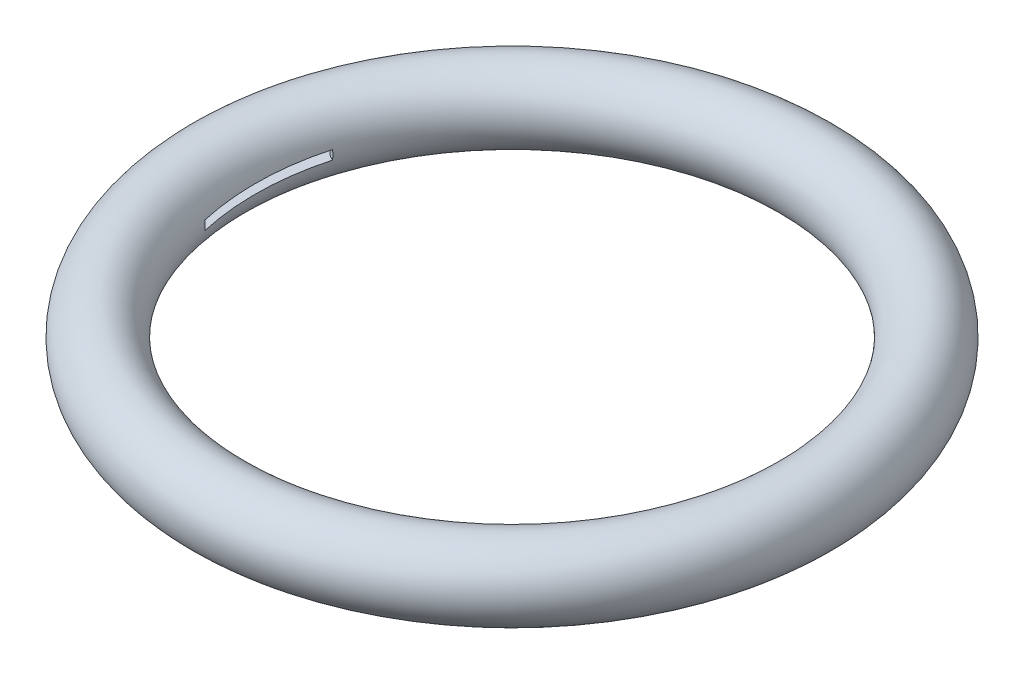
ISO-10303-21;
HEADER;
FILE_DESCRIPTION(('STEP AP214'),'2;1');
FILE_NAME('part.step','',(''),(''),'','','');
FILE_SCHEMA(('AUTOMOTIVE_DESIGN { 1 0 10303 214 1 1 1 1 }'));
ENDSEC;
DATA;
#1=APPLICATION_CONTEXT('core data for automotive mechanical design processes');
#2=APPLICATION_PROTOCOL_DEFINITION('international standard','automotive_design',2000,#1);
#3=PRODUCT_CONTEXT('',#1,'mechanical');
#4=PRODUCT('Part','Part','',(#3));
#5=PRODUCT_RELATED_PRODUCT_CATEGORY('part','',(#4));
#6=PRODUCT_DEFINITION_FORMATION('','',#4);
#7=PRODUCT_DEFINITION_CONTEXT('part definition',#1,'design');
#8=PRODUCT_DEFINITION('design','',#6,#7);
#9=PRODUCT_DEFINITION_SHAPE('','',#8);
#10=(LENGTH_UNIT() NAMED_UNIT(*) SI_UNIT(.MILLI.,.METRE.));
#11=(NAMED_UNIT(*) PLANE_ANGLE_UNIT() SI_UNIT($,.RADIAN.));
#12=(NAMED_UNIT(*) SI_UNIT($,.STERADIAN.) SOLID_ANGLE_UNIT());
#13=UNCERTAINTY_MEASURE_WITH_UNIT(LENGTH_MEASURE(1.E-05),#10,'distance_accuracy_value','');
#14=(GEOMETRIC_REPRESENTATION_CONTEXT(3) GLOBAL_UNCERTAINTY_ASSIGNED_CONTEXT((#13)) GLOBAL_UNIT_ASSIGNED_CONTEXT((#10,
#11,#12)) REPRESENTATION_CONTEXT('',''));
#15=CARTESIAN_POINT('',(0.,0.,0.));
#16=DIRECTION('',(0.,0.,1.));
#17=DIRECTION('',(1.,0.,0.));
#18=AXIS2_PLACEMENT_3D('',#15,#16,#17);
#19=CARTESIAN_POINT('',(0.,-1.5875,0.));
#20=DIRECTION('',(0.,1.,0.));
#21=DIRECTION('',(0.,0.,1.));
#22=AXIS2_PLACEMENT_3D('',#19,#20,#21);
#23=PLANE('',#22);
#24=CARTESIAN_POINT('',(0.,-1.5875,0.));
#25=DIRECTION('',(0.,1.,0.));
#26=DIRECTION('',(0.,0.,1.));
#27=AXIS2_PLACEMENT_3D('',#24,#25,#26);
#28=CIRCLE('',#27,107.95);
#29=CARTESIAN_POINT('',(0.,-1.5875,107.95));
#30=VERTEX_POINT('',#29);
#31=EDGE_CURVE('E201',#30,#30,#28,.T.);
#32=ORIENTED_EDGE('',*,*,#31,.T.);
#33=EDGE_LOOP('',(#32));
#34=FACE_BOUND('',#33,.T.);
#35=CARTESIAN_POINT('',(0.,-1.5875,0.));
#36=DIRECTION('',(0.,-1.,0.));
#37=DIRECTION('',(0.,0.,-1.));
#38=AXIS2_PLACEMENT_3D('',#35,#36,#37);
#39=CIRCLE('',#38,88.9996093810549);
#40=CARTESIAN_POINT('',(85.8121158996509,-1.5875,-23.605322171179));
#41=VERTEX_POINT('',#40);
#42=CARTESIAN_POINT('',(86.7698978263463,-1.5875,19.7968507896007));
#43=VERTEX_POINT('',#42);
#44=EDGE_CURVE('E249',#41,#43,#39,.T.);
#45=ORIENTED_EDGE('',*,*,#44,.T.);
#46=CARTESIAN_POINT('',(85.0413671985354,-1.5875,25.9070620681671));
#47=DIRECTION('',(0.,1.,0.));
#48=DIRECTION('',(0.,0.,-1.));
#49=AXIS2_PLACEMENT_3D('',#46,#47,#48);
#50=CIRCLE('',#49,6.35);
#51=CARTESIAN_POINT('',(91.1157505698594,-1.5875,27.7575665016076));
#52=VERTEX_POINT('',#51);
#53=EDGE_CURVE('E180',#52,#43,#50,.T.);
#54=ORIENTED_EDGE('',*,*,#53,.F.);
#55=CARTESIAN_POINT('',(0.,-1.5875,0.));
#56=DIRECTION('',(0.,1.,0.));
#57=DIRECTION('',(0.,0.,1.));
#58=AXIS2_PLACEMENT_3D('',#55,#56,#57);
#59=CIRCLE('',#58,95.25);
#60=CARTESIAN_POINT('',(27.7575665016076,-1.5875,91.1157505698594));
#61=VERTEX_POINT('',#60);
#62=EDGE_CURVE('E186',#61,#52,#59,.T.);
#63=ORIENTED_EDGE('',*,*,#62,.F.);
#64=CARTESIAN_POINT('',(25.9070620681671,-1.5875,85.0413671985354));
#65=DIRECTION('',(0.,1.,0.));
#66=DIRECTION('',(0.,0.,-1.));
#67=AXIS2_PLACEMENT_3D('',#64,#65,#66);
#68=CIRCLE('',#67,6.35);
#69=CARTESIAN_POINT('',(19.7968507896007,-1.5875,86.7698978263462));
#70=VERTEX_POINT('',#69);
#71=EDGE_CURVE('E183',#70,#61,#68,.T.);
#72=ORIENTED_EDGE('',*,*,#71,.F.);
#73=CARTESIAN_POINT('',(-19.7968507896006,-1.5875,86.7698978263463));
#74=VERTEX_POINT('',#73);
#75=EDGE_CURVE('E51',#70,#74,#39,.T.);
#76=ORIENTED_EDGE('',*,*,#75,.T.);
#77=CARTESIAN_POINT('',(-25.907062068167,-1.5875,85.0413671985355));
#78=DIRECTION('',(0.,1.,0.));
#79=DIRECTION('',(0.,0.,1.));
#80=AXIS2_PLACEMENT_3D('',#77,#78,#79);
#81=CIRCLE('',#80,6.35);
#82=CARTESIAN_POINT('',(-27.7575665016075,-1.5875,91.1157505698594));
#83=VERTEX_POINT('',#82);
#84=EDGE_CURVE('E58',#83,#74,#81,.T.);
#85=ORIENTED_EDGE('',*,*,#84,.F.);
#86=CARTESIAN_POINT('',(0.,-1.5875,0.));
#87=DIRECTION('',(0.,1.,0.));
#88=DIRECTION('',(0.,0.,1.));
#89=AXIS2_PLACEMENT_3D('',#86,#87,#88);
#90=CIRCLE('',#89,95.25);
#91=CARTESIAN_POINT('',(-91.1157505698594,-1.5875,27.7575665016075));
#92=VERTEX_POINT('',#91);
#93=EDGE_CURVE('E165',#92,#83,#90,.T.);
#94=ORIENTED_EDGE('',*,*,#93,.F.);
#95=CARTESIAN_POINT('',(-85.0413671985355,-1.5875,25.9070620681671));
#96=DIRECTION('',(0.,1.,0.));
#97=DIRECTION('',(0.,0.,1.));
#98=AXIS2_PLACEMENT_3D('',#95,#96,#97);
#99=CIRCLE('',#98,6.35);
#100=CARTESIAN_POINT('',(-86.7698978263463,-1.5875,19.7968507896007));
#101=VERTEX_POINT('',#100);
#102=EDGE_CURVE('E162',#101,#92,#99,.T.);
#103=ORIENTED_EDGE('',*,*,#102,.F.);
#104=CARTESIAN_POINT('',(-85.8121158996509,-1.5875,-23.605322171179));
#105=VERTEX_POINT('',#104);
#106=EDGE_CURVE('E288',#101,#105,#39,.T.);
#107=ORIENTED_EDGE('',*,*,#106,.T.);
#108=CARTESIAN_POINT('',(-83.8157237966455,-1.5875,-29.6333333333333));
#109=DIRECTION('',(0.,1.,0.));
#110=DIRECTION('',(0.,0.,-1.));
#111=AXIS2_PLACEMENT_3D('',#108,#109,#110);
#112=CIRCLE('',#111,6.35);
#113=CARTESIAN_POINT('',(-89.8025612106915,-1.5875,-31.75));
#114=VERTEX_POINT('',#113);
#115=EDGE_CURVE('E148',#114,#105,#112,.T.);
#116=ORIENTED_EDGE('',*,*,#115,.F.);
#117=CARTESIAN_POINT('',(0.,-1.5875,0.));
#118=DIRECTION('',(0.,1.,0.));
#119=DIRECTION('',(0.,0.,1.));
#120=AXIS2_PLACEMENT_3D('',#117,#118,#119);
#121=CIRCLE('',#120,95.25);
#122=CARTESIAN_POINT('',(89.8025612106915,-1.5875,-31.75));
#123=VERTEX_POINT('',#122);
#124=EDGE_CURVE('E139',#123,#114,#121,.T.);
#125=ORIENTED_EDGE('',*,*,#124,.F.);
#126=CARTESIAN_POINT('',(83.8157237966454,-1.5875,-29.6333333333333));
#127=DIRECTION('',(0.,1.,0.));
#128=DIRECTION('',(0.,0.,1.));
#129=AXIS2_PLACEMENT_3D('',#126,#127,#128);
#130=CIRCLE('',#129,6.35);
#131=EDGE_CURVE('E129',#41,#123,#130,.T.);
#132=ORIENTED_EDGE('',*,*,#131,.F.);
#133=EDGE_LOOP('',(#45,#54,#63,#72,#76,#85,#94,#103,#107,#116,#125,#132));
#134=FACE_BOUND('',#133,.T.);
#135=ADVANCED_FACE('F37',(#34,#134),#23,.T.);
#136=CARTESIAN_POINT('',(0.,1.5875,0.));
#137=DIRECTION('',(0.,1.,0.));
#138=DIRECTION('',(0.,0.,1.));
#139=AXIS2_PLACEMENT_3D('',#136,#137,#138);
#140=PLANE('',#139);
#141=CARTESIAN_POINT('',(0.,1.5875,0.));
#142=DIRECTION('',(0.,1.,0.));
#143=DIRECTION('',(0.,0.,1.));
#144=AXIS2_PLACEMENT_3D('',#141,#142,#143);
#145=CIRCLE('',#144,107.95);
#146=CARTESIAN_POINT('',(0.,1.5875,107.95));
#147=VERTEX_POINT('',#146);
#148=EDGE_CURVE('E198',#147,#147,#145,.T.);
#149=ORIENTED_EDGE('',*,*,#148,.F.);
#150=EDGE_LOOP('',(#149));
#151=FACE_BOUND('',#150,.T.);
#152=CARTESIAN_POINT('',(83.8157237966454,1.5875,-29.6333333333333));
#153=DIRECTION('',(0.,1.,0.));
#154=DIRECTION('',(0.,0.,1.));
#155=AXIS2_PLACEMENT_3D('',#152,#153,#154);
#156=CIRCLE('',#155,6.35);
#157=CARTESIAN_POINT('',(85.8121158996509,1.5875,-23.605322171179));
#158=VERTEX_POINT('',#157);
#159=CARTESIAN_POINT('',(89.8025612106915,1.5875,-31.75));
#160=VERTEX_POINT('',#159);
#161=EDGE_CURVE('E66',#158,#160,#156,.T.);
#162=ORIENTED_EDGE('',*,*,#161,.T.);
#163=CARTESIAN_POINT('',(0.,1.5875,0.));
#164=DIRECTION('',(0.,1.,0.));
#165=DIRECTION('',(0.,0.,1.));
#166=AXIS2_PLACEMENT_3D('',#163,#164,#165);
#167=CIRCLE('',#166,95.25);
#168=CARTESIAN_POINT('',(-89.8025612106916,1.5875,-31.75));
#169=VERTEX_POINT('',#168);
#170=EDGE_CURVE('E146',#160,#169,#167,.T.);
#171=ORIENTED_EDGE('',*,*,#170,.T.);
#172=CARTESIAN_POINT('',(-83.8157237966455,1.5875,-29.6333333333333));
#173=DIRECTION('',(0.,1.,0.));
#174=DIRECTION('',(0.,0.,-1.));
#175=AXIS2_PLACEMENT_3D('',#172,#173,#174);
#176=CIRCLE('',#175,6.35);
#177=CARTESIAN_POINT('',(-85.8121158996547,1.5875,-23.6053221711802));
#178=VERTEX_POINT('',#177);
#179=EDGE_CURVE('E140',#169,#178,#176,.T.);
#180=ORIENTED_EDGE('',*,*,#179,.T.);
#181=CARTESIAN_POINT('',(0.,1.5875,0.));
#182=DIRECTION('',(0.,-1.,0.));
#183=DIRECTION('',(0.,0.,-1.));
#184=AXIS2_PLACEMENT_3D('',#181,#182,#183);
#185=CIRCLE('',#184,88.9996093810549);
#186=CARTESIAN_POINT('',(-86.7698978263463,1.5875,19.7968507896007));
#187=VERTEX_POINT('',#186);
#188=EDGE_CURVE('E213',#187,#178,#185,.T.);
#189=ORIENTED_EDGE('',*,*,#188,.F.);
#190=CARTESIAN_POINT('',(-85.0413671985355,1.5875,25.9070620681671));
#191=DIRECTION('',(0.,1.,0.));
#192=DIRECTION('',(0.,0.,1.));
#193=AXIS2_PLACEMENT_3D('',#190,#191,#192);
#194=CIRCLE('',#193,6.35);
#195=CARTESIAN_POINT('',(-91.1157505698594,1.5875,27.7575665016075));
#196=VERTEX_POINT('',#195);
#197=EDGE_CURVE('E171',#187,#196,#194,.T.);
#198=ORIENTED_EDGE('',*,*,#197,.T.);
#199=CARTESIAN_POINT('',(0.,1.5875,0.));
#200=DIRECTION('',(0.,1.,0.));
#201=DIRECTION('',(0.,0.,1.));
#202=AXIS2_PLACEMENT_3D('',#199,#200,#201);
#203=CIRCLE('',#202,95.25);
#204=CARTESIAN_POINT('',(-27.7575665016075,1.5875,91.1157505698594));
#205=VERTEX_POINT('',#204);
#206=EDGE_CURVE('E163',#196,#205,#203,.T.);
#207=ORIENTED_EDGE('',*,*,#206,.T.);
#208=CARTESIAN_POINT('',(-25.907062068167,1.5875,85.0413671985355));
#209=DIRECTION('',(0.,1.,0.));
#210=DIRECTION('',(0.,0.,1.));
#211=AXIS2_PLACEMENT_3D('',#208,#209,#210);
#212=CIRCLE('',#211,6.35);
#213=CARTESIAN_POINT('',(-19.7968507896006,1.5875,86.7698978263463));
#214=VERTEX_POINT('',#213);
#215=EDGE_CURVE('E159',#205,#214,#212,.T.);
#216=ORIENTED_EDGE('',*,*,#215,.T.);
#217=CARTESIAN_POINT('',(19.7968507896007,1.5875,86.7698978263463));
#218=VERTEX_POINT('',#217);
#219=EDGE_CURVE('E285',#218,#214,#185,.T.);
#220=ORIENTED_EDGE('',*,*,#219,.F.);
#221=CARTESIAN_POINT('',(25.9070620681671,1.5875,85.0413671985354));
#222=DIRECTION('',(0.,1.,0.));
#223=DIRECTION('',(0.,0.,-1.));
#224=AXIS2_PLACEMENT_3D('',#221,#222,#223);
#225=CIRCLE('',#224,6.35);
#226=CARTESIAN_POINT('',(27.7575665016076,1.5875,91.1157505698594));
#227=VERTEX_POINT('',#226);
#228=EDGE_CURVE('E192',#218,#227,#225,.T.);
#229=ORIENTED_EDGE('',*,*,#228,.T.);
#230=CARTESIAN_POINT('',(0.,1.5875,0.));
#231=DIRECTION('',(0.,1.,0.));
#232=DIRECTION('',(0.,0.,1.));
#233=AXIS2_PLACEMENT_3D('',#230,#231,#232);
#234=CIRCLE('',#233,95.25);
#235=CARTESIAN_POINT('',(91.1157505698594,1.5875,27.7575665016076));
#236=VERTEX_POINT('',#235);
#237=EDGE_CURVE('E184',#227,#236,#234,.T.);
#238=ORIENTED_EDGE('',*,*,#237,.T.);
#239=CARTESIAN_POINT('',(85.0413671985354,1.5875,25.9070620681671));
#240=DIRECTION('',(0.,1.,0.));
#241=DIRECTION('',(0.,0.,-1.));
#242=AXIS2_PLACEMENT_3D('',#239,#240,#241);
#243=CIRCLE('',#242,6.35);
#244=CARTESIAN_POINT('',(86.7698978263462,1.5875,19.7968507896007));
#245=VERTEX_POINT('',#244);
#246=EDGE_CURVE('E177',#236,#245,#243,.T.);
#247=ORIENTED_EDGE('',*,*,#246,.T.);
#248=EDGE_CURVE('E236',#158,#245,#185,.T.);
#249=ORIENTED_EDGE('',*,*,#248,.F.);
#250=EDGE_LOOP('',(#162,#171,#180,#189,#198,#207,#216,#220,#229,#238,#247,#249));
#251=FACE_BOUND('',#250,.T.);
#252=ADVANCED_FACE('F260',(#151,#251),#140,.F.);
#253=CARTESIAN_POINT('',(85.0413671985354,-1.5875,25.9070620681671));
#254=DIRECTION('',(0.,1.,0.));
#255=DIRECTION('',(0.,0.,1.));
#256=AXIS2_PLACEMENT_3D('',#253,#254,#255);
#257=CYLINDRICAL_SURFACE('',#256,6.35);
#258=CARTESIAN_POINT('',(86.7699221060398,-1.5877,19.7968576581868));
#259=CARTESIAN_POINT('',(86.7539106304808,-1.45582316258876,19.7923314439166));
#260=CARTESIAN_POINT('',(86.7398820955855,-1.32369258619397,19.7884269937429));
#261=CARTESIAN_POINT('',(86.7158173415351,-1.05903926132754,19.7817963410247));
#262=CARTESIAN_POINT('',(86.7057811107929,-0.926516513995261,19.7790701350604));
#263=CARTESIAN_POINT('',(86.6817652672015,-0.529603825546805,19.7725784625492));
#264=CARTESIAN_POINT('',(86.6737488235011,-0.264801912773402,19.7704644578887));
#265=CARTESIAN_POINT('',(86.6737488235011,0.264801912773404,19.7704644578887));
#266=CARTESIAN_POINT('',(86.6817652672016,0.529603825546807,19.7725784625492));
#267=CARTESIAN_POINT('',(86.7057811107929,0.926516513995263,19.7790701350604));
#268=CARTESIAN_POINT('',(86.7158173415351,1.05903926132754,19.7817963410247));
#269=CARTESIAN_POINT('',(86.7398820955855,1.32369258619397,19.7884269937429));
#270=CARTESIAN_POINT('',(86.7539106304808,1.45582316258877,19.7923314439165));
#271=CARTESIAN_POINT('',(86.7699221060398,1.5877,19.7968576581868));
#272=B_SPLINE_CURVE_WITH_KNOTS('',3,(#258,#259,#260,#261,#262,#263,#264,#265,#266,#267,#268,
#269,#270,#271),.UNSPECIFIED.,.F.,.F.,(4,2,2,2,2,2,4),(0.,0.398734131817346,0.79746710635654,
1.59171099945824,2.38595489255995,2.78468786709914,3.18342199891649),.UNSPECIFIED.);
#273=EDGE_CURVE('E242',#43,#245,#272,.T.);
#274=ORIENTED_EDGE('',*,*,#273,.T.);
#275=ORIENTED_EDGE('',*,*,#246,.F.);
#276=DIRECTION('',(0.,1.,0.));
#277=VECTOR('',#276,1.);
#278=CARTESIAN_POINT('',(91.1157505698594,-1.5875,27.7575665016076));
#279=LINE('',#278,#277);
#280=EDGE_CURVE('E196',#52,#236,#279,.T.);
#281=ORIENTED_EDGE('',*,*,#280,.F.);
#282=ORIENTED_EDGE('',*,*,#53,.T.);
#283=EDGE_LOOP('',(#274,#275,#281,#282));
#284=FACE_BOUND('',#283,.T.);
#285=ADVANCED_FACE('F255',(#284),#257,.T.);
#286=CARTESIAN_POINT('',(25.9070620681671,-1.5875,85.0413671985354));
#287=DIRECTION('',(0.,1.,0.));
#288=DIRECTION('',(0.,0.,1.));
#289=AXIS2_PLACEMENT_3D('',#286,#287,#288);
#290=CYLINDRICAL_SURFACE('',#289,6.35);
#291=CARTESIAN_POINT('',(19.7968576581868,1.5877,86.7699221060398));
#292=CARTESIAN_POINT('',(19.7923314439165,1.45582316258876,86.7539106304808));
#293=CARTESIAN_POINT('',(19.7884269937429,1.32369258619397,86.7398820955855));
#294=CARTESIAN_POINT('',(19.7817963410247,1.05903926132754,86.7158173415351));
#295=CARTESIAN_POINT('',(19.7790701350604,0.926516513995262,86.7057811107929));
#296=CARTESIAN_POINT('',(19.7725784625492,0.529603825546807,86.6817652672015));
#297=CARTESIAN_POINT('',(19.7704644578887,0.264801912773403,86.6737488235011));
#298=CARTESIAN_POINT('',(19.7704644578887,-0.264801912773402,86.6737488235011));
#299=CARTESIAN_POINT('',(19.7725784625492,-0.529603825546805,86.6817652672016));
#300=CARTESIAN_POINT('',(19.7790701350604,-0.926516513995261,86.7057811107929));
#301=CARTESIAN_POINT('',(19.7817963410247,-1.05903926132754,86.7158173415351));
#302=CARTESIAN_POINT('',(19.7884269937429,-1.32369258619397,86.7398820955855));
#303=CARTESIAN_POINT('',(19.7923314439165,-1.45582316258876,86.7539106304808));
#304=CARTESIAN_POINT('',(19.7968576581868,-1.5877,86.7699221060398));
#305=B_SPLINE_CURVE_WITH_KNOTS('',3,(#291,#292,#293,#294,#295,#296,#297,#298,#299,#300,#301,
#302,#303,#304),.UNSPECIFIED.,.F.,.F.,(4,2,2,2,2,2,4),(0.,0.398734131817345,0.797467106356538,
1.59171099945824,2.38595489255994,2.78468786709914,3.18342199891648),.UNSPECIFIED.);
#306=EDGE_CURVE('E11',#218,#70,#305,.T.);
#307=ORIENTED_EDGE('',*,*,#306,.T.);
#308=ORIENTED_EDGE('',*,*,#71,.T.);
#309=DIRECTION('',(0.,1.,0.));
#310=VECTOR('',#309,1.);
#311=CARTESIAN_POINT('',(27.7575665016076,-1.5875,91.1157505698594));
#312=LINE('',#311,#310);
#313=EDGE_CURVE('E189',#61,#227,#312,.T.);
#314=ORIENTED_EDGE('',*,*,#313,.T.);
#315=ORIENTED_EDGE('',*,*,#228,.F.);
#316=EDGE_LOOP('',(#307,#308,#314,#315));
#317=FACE_BOUND('',#316,.T.);
#318=ADVANCED_FACE('F259',(#317),#290,.T.);
#319=CARTESIAN_POINT('',(-25.907062068167,-1.5875,85.0413671985355));
#320=DIRECTION('',(0.,1.,0.));
#321=DIRECTION('',(0.,0.,1.));
#322=AXIS2_PLACEMENT_3D('',#319,#320,#321);
#323=CYLINDRICAL_SURFACE('',#322,6.35);
#324=CARTESIAN_POINT('',(-19.7968576581867,-1.5877,86.7699221060398));
#325=CARTESIAN_POINT('',(-19.7923314439165,-1.45582316258876,86.7539106304808));
#326=CARTESIAN_POINT('',(-19.7884269937428,-1.32369258619397,86.7398820955855));
#327=CARTESIAN_POINT('',(-19.7817963410246,-1.05903926132754,86.7158173415351));
#328=CARTESIAN_POINT('',(-19.7790701350603,-0.926516513995261,86.7057811107929));
#329=CARTESIAN_POINT('',(-19.7725784625491,-0.529603825546806,86.6817652672016));
#330=CARTESIAN_POINT('',(-19.7704644578886,-0.264801912773403,86.6737488235011));
#331=CARTESIAN_POINT('',(-19.7704644578886,0.264801912773403,86.6737488235011));
#332=CARTESIAN_POINT('',(-19.7725784625491,0.529603825546805,86.6817652672016));
#333=CARTESIAN_POINT('',(-19.7790701350603,0.92651651399526,86.7057811107929));
#334=CARTESIAN_POINT('',(-19.7817963410246,1.05903926132754,86.7158173415351));
#335=CARTESIAN_POINT('',(-19.7884269937428,1.32369258619397,86.7398820955855));
#336=CARTESIAN_POINT('',(-19.7923314439164,1.45582316258876,86.7539106304808));
#337=CARTESIAN_POINT('',(-19.7968576581867,1.5877,86.7699221060399));
#338=B_SPLINE_CURVE_WITH_KNOTS('',3,(#324,#325,#326,#327,#328,#329,#330,#331,#332,#333,#334,
#335,#336,#337),.UNSPECIFIED.,.F.,.F.,(4,2,2,2,2,2,4),(0.,0.398734131817348,0.797467106356541,
1.59171099945824,2.38595489255995,2.78468786709914,3.18342199891649),.UNSPECIFIED.);
#339=EDGE_CURVE('E248',#74,#214,#338,.T.);
#340=ORIENTED_EDGE('',*,*,#339,.T.);
#341=ORIENTED_EDGE('',*,*,#215,.F.);
#342=DIRECTION('',(0.,1.,0.));
#343=VECTOR('',#342,1.);
#344=CARTESIAN_POINT('',(-27.7575665016075,-1.5875,91.1157505698594));
#345=LINE('',#344,#343);
#346=EDGE_CURVE('E175',#83,#205,#345,.T.);
#347=ORIENTED_EDGE('',*,*,#346,.F.);
#348=ORIENTED_EDGE('',*,*,#84,.T.);
#349=EDGE_LOOP('',(#340,#341,#347,#348));
#350=FACE_BOUND('',#349,.T.);
#351=ADVANCED_FACE('F307',(#350),#323,.T.);
#352=CARTESIAN_POINT('',(-85.0413671985355,-1.5875,25.9070620681671));
#353=DIRECTION('',(0.,1.,0.));
#354=DIRECTION('',(0.,0.,1.));
#355=AXIS2_PLACEMENT_3D('',#352,#353,#354);
#356=CYLINDRICAL_SURFACE('',#355,6.35);
#357=CARTESIAN_POINT('',(-86.7699221060398,1.5877,19.7968576581868));
#358=CARTESIAN_POINT('',(-86.7539106304808,1.45582316258876,19.7923314439165));
#359=CARTESIAN_POINT('',(-86.7398820955855,1.32369258619397,19.7884269937428));
#360=CARTESIAN_POINT('',(-86.7158173415351,1.05903926132754,19.7817963410246));
#361=CARTESIAN_POINT('',(-86.7057811107929,0.926516513995262,19.7790701350604));
#362=CARTESIAN_POINT('',(-86.6817652672016,0.529603825546807,19.7725784625492));
#363=CARTESIAN_POINT('',(-86.6737488235011,0.264801912773404,19.7704644578887));
#364=CARTESIAN_POINT('',(-86.6737488235011,-0.264801912773403,19.7704644578887));
#365=CARTESIAN_POINT('',(-86.6817652672015,-0.529603825546807,19.7725784625492));
#366=CARTESIAN_POINT('',(-86.7057811107929,-0.926516513995261,19.7790701350604));
#367=CARTESIAN_POINT('',(-86.7158173415351,-1.05903926132754,19.7817963410246));
#368=CARTESIAN_POINT('',(-86.7398820955855,-1.32369258619397,19.7884269937428));
#369=CARTESIAN_POINT('',(-86.7539106304808,-1.45582316258876,19.7923314439165));
#370=CARTESIAN_POINT('',(-86.7699221060398,-1.5877,19.7968576581867));
#371=B_SPLINE_CURVE_WITH_KNOTS('',3,(#357,#358,#359,#360,#361,#362,#363,#364,#365,#366,#367,
#368,#369,#370),.UNSPECIFIED.,.F.,.F.,(4,2,2,2,2,2,4),(0.,0.398734131817348,0.797467106356541,
1.59171099945824,2.38595489255995,2.78468786709914,3.18342199891649),.UNSPECIFIED.);
#372=EDGE_CURVE('E237',#187,#101,#371,.T.);
#373=ORIENTED_EDGE('',*,*,#372,.T.);
#374=ORIENTED_EDGE('',*,*,#102,.T.);
#375=DIRECTION('',(0.,1.,0.));
#376=VECTOR('',#375,1.);
#377=CARTESIAN_POINT('',(-91.1157505698594,-1.5875,27.7575665016075));
#378=LINE('',#377,#376);
#379=EDGE_CURVE('E168',#92,#196,#378,.T.);
#380=ORIENTED_EDGE('',*,*,#379,.T.);
#381=ORIENTED_EDGE('',*,*,#197,.F.);
#382=EDGE_LOOP('',(#373,#374,#380,#381));
#383=FACE_BOUND('',#382,.T.);
#384=ADVANCED_FACE('F227',(#383),#356,.T.);
#385=CARTESIAN_POINT('',(83.8157237966454,-1.5875,-29.6333333333333));
#386=DIRECTION('',(0.,1.,0.));
#387=DIRECTION('',(0.,0.,1.));
#388=AXIS2_PLACEMENT_3D('',#385,#386,#387);
#389=CYLINDRICAL_SURFACE('',#388,6.35);
#390=CARTESIAN_POINT('',(85.8121398527097,1.5877,-23.6053301041464));
#391=CARTESIAN_POINT('',(85.7963436322342,1.45582316258876,-23.6001019702644));
#392=CARTESIAN_POINT('',(85.7825009937316,1.32369258619397,-23.5955824700982));
#393=CARTESIAN_POINT('',(85.75875216912,1.05903926132754,-23.5878966863031));
#394=CARTESIAN_POINT('',(85.7488459715861,0.926516513995261,-23.5847303987468));
#395=CARTESIAN_POINT('',(85.7251398788856,0.529603825546806,-23.5771856174862));
#396=CARTESIAN_POINT('',(85.7172244956836,0.264801912773403,-23.5747200355929));
#397=CARTESIAN_POINT('',(85.7172244956836,-0.264801912773403,-23.5747200355929));
#398=CARTESIAN_POINT('',(85.7251398788856,-0.529603825546806,-23.5771856174862));
#399=CARTESIAN_POINT('',(85.7488459715861,-0.926516513995262,-23.5847303987468));
#400=CARTESIAN_POINT('',(85.75875216912,-1.05903926132754,-23.5878966863031));
#401=CARTESIAN_POINT('',(85.7825009937316,-1.32369258619397,-23.5955824700982));
#402=CARTESIAN_POINT('',(85.7963436322342,-1.45582316258876,-23.6001019702644));
#403=CARTESIAN_POINT('',(85.8121398527097,-1.5877,-23.6053301041463));
#404=B_SPLINE_CURVE_WITH_KNOTS('',3,(#390,#391,#392,#393,#394,#395,#396,#397,#398,#399,#400,
#401,#402,#403),.UNSPECIFIED.,.F.,.F.,(4,2,2,2,2,2,4),(0.,0.398734131817346,0.79746710635654,
1.59171099945824,2.38595489255995,2.78468786709914,3.18342199891648),.UNSPECIFIED.);
#405=EDGE_CURVE('E135',#158,#41,#404,.T.);
#406=ORIENTED_EDGE('',*,*,#405,.T.);
#407=ORIENTED_EDGE('',*,*,#131,.T.);
#408=DIRECTION('',(0.,1.,0.));
#409=VECTOR('',#408,1.);
#410=CARTESIAN_POINT('',(89.8025612106915,-1.5875,-31.75));
#411=LINE('',#410,#409);
#412=EDGE_CURVE('E132',#123,#160,#411,.T.);
#413=ORIENTED_EDGE('',*,*,#412,.T.);
#414=ORIENTED_EDGE('',*,*,#161,.F.);
#415=EDGE_LOOP('',(#406,#407,#413,#414));
#416=FACE_BOUND('',#415,.T.);
#417=ADVANCED_FACE('F131',(#416),#389,.T.);
#418=CARTESIAN_POINT('',(-83.8157237966455,-1.5875,-29.6333333333333));
#419=DIRECTION('',(0.,1.,0.));
#420=DIRECTION('',(0.,0.,1.));
#421=AXIS2_PLACEMENT_3D('',#418,#419,#420);
#422=CYLINDRICAL_SURFACE('',#421,6.35);
#423=CARTESIAN_POINT('',(-85.8121398527097,-1.5877,-23.6053301041463));
#424=CARTESIAN_POINT('',(-85.7963436322342,-1.45582316258876,-23.6001019702644));
#425=CARTESIAN_POINT('',(-85.7825009937316,-1.32369258619397,-23.5955824700981));
#426=CARTESIAN_POINT('',(-85.75875216912,-1.05903926132754,-23.5878966863031));
#427=CARTESIAN_POINT('',(-85.7488459715861,-0.926516513995261,-23.5847303987467));
#428=CARTESIAN_POINT('',(-85.7251398788856,-0.529603825546806,-23.5771856174862));
#429=CARTESIAN_POINT('',(-85.7172244956836,-0.264801912773403,-23.5747200355929));
#430=CARTESIAN_POINT('',(-85.7172244956836,0.264801912773403,-23.5747200355929));
#431=CARTESIAN_POINT('',(-85.7251398788856,0.529603825546807,-23.5771856174861));
#432=CARTESIAN_POINT('',(-85.7488459715861,0.926516513995261,-23.5847303987467));
#433=CARTESIAN_POINT('',(-85.75875216912,1.05903926132754,-23.5878966863031));
#434=CARTESIAN_POINT('',(-85.7825009937316,1.32369258619396,-23.5955824700981));
#435=CARTESIAN_POINT('',(-85.7963436322343,1.45582316258876,-23.6001019702643));
#436=CARTESIAN_POINT('',(-85.8121398527097,1.5877,-23.6053301041463));
#437=B_SPLINE_CURVE_WITH_KNOTS('',3,(#423,#424,#425,#426,#427,#428,#429,#430,#431,#432,#433,
#434,#435,#436),.UNSPECIFIED.,.F.,.F.,(4,2,2,2,2,2,4),(0.,0.398734131817347,0.797467106356539,
1.59171099945824,2.38595489255994,2.78468786709914,3.18342199891648),.UNSPECIFIED.);
#438=EDGE_CURVE('E204',#105,#178,#437,.T.);
#439=ORIENTED_EDGE('',*,*,#438,.T.);
#440=ORIENTED_EDGE('',*,*,#179,.F.);
#441=DIRECTION('',(0.,1.,0.));
#442=VECTOR('',#441,1.);
#443=CARTESIAN_POINT('',(-89.8025612106916,-1.5875,-31.75));
#444=LINE('',#443,#442);
#445=EDGE_CURVE('E147',#114,#169,#444,.T.);
#446=ORIENTED_EDGE('',*,*,#445,.F.);
#447=ORIENTED_EDGE('',*,*,#115,.T.);
#448=EDGE_LOOP('',(#439,#440,#446,#447));
#449=FACE_BOUND('',#448,.T.);
#450=ADVANCED_FACE('F215',(#449),#422,.T.);
#451=CARTESIAN_POINT('',(0.,-1.5875,0.));
#452=DIRECTION('',(0.,1.,0.));
#453=DIRECTION('',(0.,0.,1.));
#454=AXIS2_PLACEMENT_3D('',#451,#452,#453);
#455=CYLINDRICAL_SURFACE('',#454,107.95);
#456=ORIENTED_EDGE('',*,*,#31,.F.);
#457=EDGE_LOOP('',(#456));
#458=FACE_BOUND('',#457,.T.);
#459=ORIENTED_EDGE('',*,*,#148,.T.);
#460=EDGE_LOOP('',(#459));
#461=FACE_BOUND('',#460,.T.);
#462=ADVANCED_FACE('F219',(#458,#461),#455,.F.);
#463=CARTESIAN_POINT('',(0.,-1.5875,0.));
#464=DIRECTION('',(0.,1.,0.));
#465=DIRECTION('',(0.,0.,1.));
#466=AXIS2_PLACEMENT_3D('',#463,#464,#465);
#467=CYLINDRICAL_SURFACE('',#466,95.25);
#468=ORIENTED_EDGE('',*,*,#237,.F.);
#469=ORIENTED_EDGE('',*,*,#313,.F.);
#470=ORIENTED_EDGE('',*,*,#62,.T.);
#471=ORIENTED_EDGE('',*,*,#280,.T.);
#472=EDGE_LOOP('',(#468,#469,#470,#471));
#473=FACE_BOUND('',#472,.T.);
#474=ADVANCED_FACE('F270',(#473),#467,.T.);
#475=CARTESIAN_POINT('',(0.,-1.5875,0.));
#476=DIRECTION('',(0.,1.,0.));
#477=DIRECTION('',(0.,0.,1.));
#478=AXIS2_PLACEMENT_3D('',#475,#476,#477);
#479=CYLINDRICAL_SURFACE('',#478,95.25);
#480=ORIENTED_EDGE('',*,*,#206,.F.);
#481=ORIENTED_EDGE('',*,*,#379,.F.);
#482=ORIENTED_EDGE('',*,*,#93,.T.);
#483=ORIENTED_EDGE('',*,*,#346,.T.);
#484=EDGE_LOOP('',(#480,#481,#482,#483));
#485=FACE_BOUND('',#484,.T.);
#486=ADVANCED_FACE('F223',(#485),#479,.T.);
#487=CARTESIAN_POINT('',(0.,-1.5875,0.));
#488=DIRECTION('',(0.,1.,0.));
#489=DIRECTION('',(0.,0.,1.));
#490=AXIS2_PLACEMENT_3D('',#487,#488,#489);
#491=CYLINDRICAL_SURFACE('',#490,95.25);
#492=ORIENTED_EDGE('',*,*,#170,.F.);
#493=ORIENTED_EDGE('',*,*,#412,.F.);
#494=ORIENTED_EDGE('',*,*,#124,.T.);
#495=ORIENTED_EDGE('',*,*,#445,.T.);
#496=EDGE_LOOP('',(#492,#493,#494,#495));
#497=FACE_BOUND('',#496,.T.);
#498=ADVANCED_FACE('F144',(#497),#491,.T.);
#499=CARTESIAN_POINT('',(0.,0.,0.));
#500=DIRECTION('',(0.,1.,0.));
#501=DIRECTION('',(-1.,0.,0.));
#502=AXIS2_PLACEMENT_3D('',#499,#500,#501);
#503=TOROIDAL_SURFACE('',#502,101.6,12.7);
#504=ORIENTED_EDGE('',*,*,#273,.F.);
#505=ORIENTED_EDGE('',*,*,#44,.F.);
#506=ORIENTED_EDGE('',*,*,#405,.F.);
#507=ORIENTED_EDGE('',*,*,#248,.T.);
#508=EDGE_LOOP('',(#504,#505,#506,#507));
#509=FACE_BOUND('',#508,.T.);
#510=ORIENTED_EDGE('',*,*,#372,.F.);
#511=ORIENTED_EDGE('',*,*,#188,.T.);
#512=ORIENTED_EDGE('',*,*,#438,.F.);
#513=ORIENTED_EDGE('',*,*,#106,.F.);
#514=EDGE_LOOP('',(#510,#511,#512,#513));
#515=FACE_BOUND('',#514,.T.);
#516=ORIENTED_EDGE('',*,*,#306,.F.);
#517=ORIENTED_EDGE('',*,*,#219,.T.);
#518=ORIENTED_EDGE('',*,*,#339,.F.);
#519=ORIENTED_EDGE('',*,*,#75,.F.);
#520=EDGE_LOOP('',(#516,#517,#518,#519));
#521=FACE_BOUND('',#520,.T.);
#522=ADVANCED_FACE('F39',(#509,#515,#521),#503,.T.);
#523=CLOSED_SHELL('',(#135,#252,#285,#318,#351,#384,#417,#450,#462,#474,#486,#498,#522));
#524=MANIFOLD_SOLID_BREP('B2',#523);
#525=ADVANCED_BREP_SHAPE_REPRESENTATION('',(#18,#524),#14);
#526=SHAPE_DEFINITION_REPRESENTATION(#9,#525);
ENDSEC;
END-ISO-10303-21;
